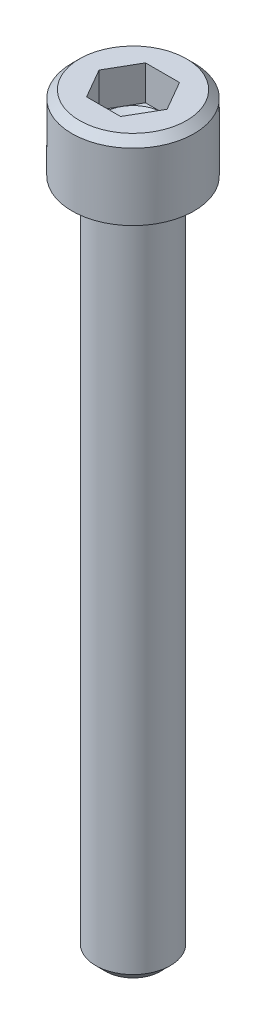
ISO-10303-21;
HEADER;
FILE_DESCRIPTION(('STEP AP214'),'2;1');
FILE_NAME('part.step','',(''),(''),'','','');
FILE_SCHEMA(('AUTOMOTIVE_DESIGN { 1 0 10303 214 1 1 1 1 }'));
ENDSEC;
DATA;
#1=APPLICATION_CONTEXT('core data for automotive mechanical design processes');
#2=APPLICATION_PROTOCOL_DEFINITION('international standard','automotive_design',2000,#1);
#3=PRODUCT_CONTEXT('',#1,'mechanical');
#4=PRODUCT('Part','Part','',(#3));
#5=PRODUCT_RELATED_PRODUCT_CATEGORY('part','',(#4));
#6=PRODUCT_DEFINITION_FORMATION('','',#4);
#7=PRODUCT_DEFINITION_CONTEXT('part definition',#1,'design');
#8=PRODUCT_DEFINITION('design','',#6,#7);
#9=PRODUCT_DEFINITION_SHAPE('','',#8);
#10=(LENGTH_UNIT() NAMED_UNIT(*) SI_UNIT(.MILLI.,.METRE.));
#11=(NAMED_UNIT(*) PLANE_ANGLE_UNIT() SI_UNIT($,.RADIAN.));
#12=(NAMED_UNIT(*) SI_UNIT($,.STERADIAN.) SOLID_ANGLE_UNIT());
#13=UNCERTAINTY_MEASURE_WITH_UNIT(LENGTH_MEASURE(1.E-05),#10,'distance_accuracy_value','');
#14=(GEOMETRIC_REPRESENTATION_CONTEXT(3) GLOBAL_UNCERTAINTY_ASSIGNED_CONTEXT((#13)) GLOBAL_UNIT_ASSIGNED_CONTEXT((#10,
#11,#12)) REPRESENTATION_CONTEXT('',''));
#15=CARTESIAN_POINT('',(0.,0.,0.));
#16=DIRECTION('',(0.,0.,1.));
#17=DIRECTION('',(1.,0.,0.));
#18=AXIS2_PLACEMENT_3D('',#15,#16,#17);
#19=CARTESIAN_POINT('',(0.,1.8796,0.));
#20=DIRECTION('',(0.,1.,0.));
#21=DIRECTION('',(0.,0.,1.));
#22=AXIS2_PLACEMENT_3D('',#19,#20,#21);
#23=PLANE('',#22);
#24=DIRECTION('',(-1.,0.,0.));
#25=VECTOR('',#24,1.);
#26=CARTESIAN_POINT('',(0.799225977638982,1.8796,-1.38429999999987));
#27=LINE('',#26,#25);
#28=CARTESIAN_POINT('',(0.799225977638982,1.8796,-1.38429999999987));
#29=VERTEX_POINT('',#28);
#30=CARTESIAN_POINT('',(0.,1.87959999999497,-1.38429999999987));
#31=VERTEX_POINT('',#30);
#32=EDGE_CURVE('E159',#29,#31,#27,.T.);
#33=ORIENTED_EDGE('',*,*,#32,.T.);
#34=CARTESIAN_POINT('',(0.,1.87959999999497,0.));
#35=DIRECTION('',(0.,-1.,0.));
#36=DIRECTION('',(0.,0.,-1.));
#37=AXIS2_PLACEMENT_3D('',#34,#35,#36);
#38=CIRCLE('',#37,1.38430000004078);
#39=CARTESIAN_POINT('',(1.19883896649411,1.87959999999497,-0.692150000020388));
#40=VERTEX_POINT('',#39);
#41=EDGE_CURVE('E47',#31,#40,#38,.T.);
#42=ORIENTED_EDGE('',*,*,#41,.T.);
#43=DIRECTION('',(-0.5,0.,-0.866025403784439));
#44=VECTOR('',#43,1.);
#45=CARTESIAN_POINT('',(1.59845195527816,1.8796,0.));
#46=LINE('',#45,#44);
#47=EDGE_CURVE('E286',#40,#29,#46,.T.);
#48=ORIENTED_EDGE('',*,*,#47,.T.);
#49=EDGE_LOOP('',(#33,#42,#48));
#50=FACE_BOUND('',#49,.T.);
#51=ADVANCED_FACE('F32',(#50),#23,.T.);
#52=CARTESIAN_POINT('',(1.59845195527816,1.8796,0.));
#53=VERTEX_POINT('',#52);
#54=EDGE_CURVE('E287',#53,#40,#46,.T.);
#55=ORIENTED_EDGE('',*,*,#54,.T.);
#56=CARTESIAN_POINT('',(1.19883896649411,1.87959999999497,0.692150000020388));
#57=VERTEX_POINT('',#56);
#58=EDGE_CURVE('E200',#40,#57,#38,.T.);
#59=ORIENTED_EDGE('',*,*,#58,.T.);
#60=DIRECTION('',(0.5,0.,-0.866025403784439));
#61=VECTOR('',#60,1.);
#62=CARTESIAN_POINT('',(0.799225977639064,1.8796,1.38429999999992));
#63=LINE('',#62,#61);
#64=EDGE_CURVE('E283',#57,#53,#63,.T.);
#65=ORIENTED_EDGE('',*,*,#64,.T.);
#66=EDGE_LOOP('',(#55,#59,#65));
#67=FACE_BOUND('',#66,.T.);
#68=ADVANCED_FACE('F122',(#67),#23,.T.);
#69=CARTESIAN_POINT('',(0.799225977639064,1.8796,1.38429999999992));
#70=VERTEX_POINT('',#69);
#71=EDGE_CURVE('E273',#70,#57,#63,.T.);
#72=ORIENTED_EDGE('',*,*,#71,.T.);
#73=CARTESIAN_POINT('',(0.,1.87959999999497,1.38430000004078));
#74=VERTEX_POINT('',#73);
#75=EDGE_CURVE('E295',#57,#74,#38,.T.);
#76=ORIENTED_EDGE('',*,*,#75,.T.);
#77=DIRECTION('',(1.,0.,0.));
#78=VECTOR('',#77,1.);
#79=CARTESIAN_POINT('',(-0.799225977639255,1.8796,1.38429999999992));
#80=LINE('',#79,#78);
#81=EDGE_CURVE('E181',#74,#70,#80,.T.);
#82=ORIENTED_EDGE('',*,*,#81,.T.);
#83=EDGE_LOOP('',(#72,#76,#82));
#84=FACE_BOUND('',#83,.T.);
#85=ADVANCED_FACE('F128',(#84),#23,.T.);
#86=CARTESIAN_POINT('',(-0.799225977639255,1.8796,1.38429999999992));
#87=VERTEX_POINT('',#86);
#88=EDGE_CURVE('E276',#87,#74,#80,.T.);
#89=ORIENTED_EDGE('',*,*,#88,.T.);
#90=CARTESIAN_POINT('',(-1.19883896649414,1.87959999999497,0.692150000020335));
#91=VERTEX_POINT('',#90);
#92=EDGE_CURVE('E282',#74,#91,#38,.T.);
#93=ORIENTED_EDGE('',*,*,#92,.T.);
#94=DIRECTION('',(0.499999999999962,0.,0.866025403784461));
#95=VECTOR('',#94,1.);
#96=CARTESIAN_POINT('',(-1.59845195527835,1.8796,0.));
#97=LINE('',#96,#95);
#98=EDGE_CURVE('E154',#91,#87,#97,.T.);
#99=ORIENTED_EDGE('',*,*,#98,.T.);
#100=EDGE_LOOP('',(#89,#93,#99));
#101=FACE_BOUND('',#100,.T.);
#102=ADVANCED_FACE('F143',(#101),#23,.T.);
#103=CARTESIAN_POINT('',(-1.59845195527835,1.8796,0.));
#104=VERTEX_POINT('',#103);
#105=EDGE_CURVE('E157',#104,#91,#97,.T.);
#106=ORIENTED_EDGE('',*,*,#105,.T.);
#107=CARTESIAN_POINT('',(-1.19883896649411,1.87959999999497,-0.692150000020388));
#108=VERTEX_POINT('',#107);
#109=EDGE_CURVE('E294',#91,#108,#38,.T.);
#110=ORIENTED_EDGE('',*,*,#109,.T.);
#111=DIRECTION('',(-0.5,0.,0.866025403784439));
#112=VECTOR('',#111,1.);
#113=CARTESIAN_POINT('',(-0.799225977639255,1.8796,-1.38429999999987));
#114=LINE('',#113,#112);
#115=EDGE_CURVE('E155',#108,#104,#114,.T.);
#116=ORIENTED_EDGE('',*,*,#115,.T.);
#117=EDGE_LOOP('',(#106,#110,#116));
#118=FACE_BOUND('',#117,.T.);
#119=ADVANCED_FACE('F134',(#118),#23,.T.);
#120=CARTESIAN_POINT('',(-0.799225977639255,1.8796,-1.38429999999987));
#121=VERTEX_POINT('',#120);
#122=EDGE_CURVE('E147',#121,#108,#114,.T.);
#123=ORIENTED_EDGE('',*,*,#122,.T.);
#124=EDGE_CURVE('E148',#108,#31,#38,.T.);
#125=ORIENTED_EDGE('',*,*,#124,.T.);
#126=EDGE_CURVE('E150',#31,#121,#27,.T.);
#127=ORIENTED_EDGE('',*,*,#126,.T.);
#128=EDGE_LOOP('',(#123,#125,#127));
#129=FACE_BOUND('',#128,.T.);
#130=ADVANCED_FACE('F124',(#129),#23,.T.);
#131=CARTESIAN_POINT('',(0.,0.,0.));
#132=DIRECTION('',(0.,-1.,0.));
#133=DIRECTION('',(0.,0.,-1.));
#134=AXIS2_PLACEMENT_3D('',#131,#132,#133);
#135=PLANE('',#134);
#136=CARTESIAN_POINT('',(0.,0.,0.));
#137=DIRECTION('',(0.,-1.,0.));
#138=DIRECTION('',(0.,0.,-1.));
#139=AXIS2_PLACEMENT_3D('',#136,#137,#138);
#140=CIRCLE('',#139,2.0066);
#141=CARTESIAN_POINT('',(0.,0.,-2.0066));
#142=VERTEX_POINT('',#141);
#143=EDGE_CURVE('E11',#142,#142,#140,.F.);
#144=ORIENTED_EDGE('',*,*,#143,.T.);
#145=EDGE_LOOP('',(#144));
#146=FACE_BOUND('',#145,.T.);
#147=CARTESIAN_POINT('',(0.,0.,0.));
#148=DIRECTION('',(0.,-1.,0.));
#149=DIRECTION('',(0.,0.,-1.));
#150=AXIS2_PLACEMENT_3D('',#147,#148,#149);
#151=CIRCLE('',#150,2.8702);
#152=CARTESIAN_POINT('',(0.,0.,-2.8702));
#153=VERTEX_POINT('',#152);
#154=EDGE_CURVE('E184',#153,#153,#151,.T.);
#155=ORIENTED_EDGE('',*,*,#154,.T.);
#156=EDGE_LOOP('',(#155));
#157=FACE_BOUND('',#156,.T.);
#158=ADVANCED_FACE('F133',(#146,#157),#135,.T.);
#159=CARTESIAN_POINT('',(0.,3.5052,0.));
#160=DIRECTION('',(0.,-1.,0.));
#161=DIRECTION('',(0.,0.,-1.));
#162=AXIS2_PLACEMENT_3D('',#159,#160,#161);
#163=CYLINDRICAL_SURFACE('',#162,2.8702);
#164=CARTESIAN_POINT('',(0.,3.14960000004543,0.));
#165=DIRECTION('',(0.,1.,0.));
#166=DIRECTION('',(0.,0.,1.));
#167=AXIS2_PLACEMENT_3D('',#164,#165,#166);
#168=CIRCLE('',#167,2.8702);
#169=CARTESIAN_POINT('',(0.,3.14960000004543,2.8702));
#170=VERTEX_POINT('',#169);
#171=EDGE_CURVE('E203',#170,#170,#168,.F.);
#172=ORIENTED_EDGE('',*,*,#171,.T.);
#173=EDGE_LOOP('',(#172));
#174=FACE_BOUND('',#173,.T.);
#175=ORIENTED_EDGE('',*,*,#154,.F.);
#176=EDGE_LOOP('',(#175));
#177=FACE_BOUND('',#176,.T.);
#178=ADVANCED_FACE('F140',(#174,#177),#163,.T.);
#179=CARTESIAN_POINT('',(2.8702,3.5052,0.));
#180=DIRECTION('',(0.,1.,0.));
#181=DIRECTION('',(0.,0.,1.));
#182=AXIS2_PLACEMENT_3D('',#179,#180,#181);
#183=PLANE('',#182);
#184=CARTESIAN_POINT('',(0.,3.5052,0.));
#185=DIRECTION('',(0.,1.,0.));
#186=DIRECTION('',(0.,0.,1.));
#187=AXIS2_PLACEMENT_3D('',#184,#185,#186);
#188=CIRCLE('',#187,2.51459999998859);
#189=CARTESIAN_POINT('',(0.,3.5052,2.51459999998859));
#190=VERTEX_POINT('',#189);
#191=EDGE_CURVE('E206',#190,#190,#188,.T.);
#192=ORIENTED_EDGE('',*,*,#191,.T.);
#193=EDGE_LOOP('',(#192));
#194=FACE_BOUND('',#193,.T.);
#195=DIRECTION('',(1.,0.,0.));
#196=VECTOR('',#195,1.);
#197=CARTESIAN_POINT('',(-0.799225977639255,3.5052,1.38429999999992));
#198=LINE('',#197,#196);
#199=CARTESIAN_POINT('',(-0.799225977639255,3.5052,1.38429999999992));
#200=VERTEX_POINT('',#199);
#201=CARTESIAN_POINT('',(0.799225977639064,3.5052,1.38429999999992));
#202=VERTEX_POINT('',#201);
#203=EDGE_CURVE('E55',#200,#202,#198,.T.);
#204=ORIENTED_EDGE('',*,*,#203,.F.);
#205=DIRECTION('',(0.499999999999962,0.,0.866025403784461));
#206=VECTOR('',#205,1.);
#207=CARTESIAN_POINT('',(-1.59845195527835,3.5052,0.));
#208=LINE('',#207,#206);
#209=CARTESIAN_POINT('',(-1.59845195527835,3.5052,0.));
#210=VERTEX_POINT('',#209);
#211=EDGE_CURVE('E178',#210,#200,#208,.T.);
#212=ORIENTED_EDGE('',*,*,#211,.F.);
#213=DIRECTION('',(-0.5,0.,0.866025403784439));
#214=VECTOR('',#213,1.);
#215=CARTESIAN_POINT('',(-0.799225977639255,3.5052,-1.38429999999987));
#216=LINE('',#215,#214);
#217=CARTESIAN_POINT('',(-0.799225977639255,3.5052,-1.38429999999987));
#218=VERTEX_POINT('',#217);
#219=EDGE_CURVE('E175',#218,#210,#216,.T.);
#220=ORIENTED_EDGE('',*,*,#219,.F.);
#221=DIRECTION('',(-1.,0.,0.));
#222=VECTOR('',#221,1.);
#223=CARTESIAN_POINT('',(0.799225977638982,3.5052,-1.38429999999987));
#224=LINE('',#223,#222);
#225=CARTESIAN_POINT('',(0.799225977638982,3.5052,-1.38429999999987));
#226=VERTEX_POINT('',#225);
#227=EDGE_CURVE('E172',#226,#218,#224,.T.);
#228=ORIENTED_EDGE('',*,*,#227,.F.);
#229=DIRECTION('',(-0.5,0.,-0.866025403784439));
#230=VECTOR('',#229,1.);
#231=CARTESIAN_POINT('',(1.59845195527816,3.5052,0.));
#232=LINE('',#231,#230);
#233=CARTESIAN_POINT('',(1.59845195527816,3.5052,0.));
#234=VERTEX_POINT('',#233);
#235=EDGE_CURVE('E169',#234,#226,#232,.T.);
#236=ORIENTED_EDGE('',*,*,#235,.F.);
#237=DIRECTION('',(0.5,0.,-0.866025403784439));
#238=VECTOR('',#237,1.);
#239=CARTESIAN_POINT('',(0.799225977639064,3.5052,1.38429999999992));
#240=LINE('',#239,#238);
#241=EDGE_CURVE('E166',#202,#234,#240,.T.);
#242=ORIENTED_EDGE('',*,*,#241,.F.);
#243=EDGE_LOOP('',(#204,#212,#220,#228,#236,#242));
#244=FACE_BOUND('',#243,.T.);
#245=ADVANCED_FACE('F225',(#194,#244),#183,.T.);
#246=CARTESIAN_POINT('',(0.,-31.75,0.));
#247=DIRECTION('',(0.,1.,0.));
#248=DIRECTION('',(0.,0.,1.));
#249=AXIS2_PLACEMENT_3D('',#246,#247,#248);
#250=CYLINDRICAL_SURFACE('',#249,1.7526);
#251=CARTESIAN_POINT('',(0.,-0.253999999999997,0.));
#252=DIRECTION('',(0.,-1.,0.));
#253=DIRECTION('',(0.,0.,-1.));
#254=AXIS2_PLACEMENT_3D('',#251,#252,#253);
#255=CIRCLE('',#254,1.7526);
#256=CARTESIAN_POINT('',(0.,-0.253999999999997,-1.7526));
#257=VERTEX_POINT('',#256);
#258=EDGE_CURVE('E40',#257,#257,#255,.T.);
#259=ORIENTED_EDGE('',*,*,#258,.T.);
#260=EDGE_LOOP('',(#259));
#261=FACE_BOUND('',#260,.T.);
#262=CARTESIAN_POINT('',(0.,-31.2775599999883,0.));
#263=DIRECTION('',(0.,-1.,0.));
#264=DIRECTION('',(0.,0.,-1.));
#265=AXIS2_PLACEMENT_3D('',#262,#263,#264);
#266=CIRCLE('',#265,1.7526);
#267=CARTESIAN_POINT('',(0.,-31.2775599999883,-1.7526));
#268=VERTEX_POINT('',#267);
#269=EDGE_CURVE('E199',#268,#268,#266,.F.);
#270=ORIENTED_EDGE('',*,*,#269,.T.);
#271=EDGE_LOOP('',(#270));
#272=FACE_BOUND('',#271,.T.);
#273=ADVANCED_FACE('F211',(#261,#272),#250,.T.);
#274=CARTESIAN_POINT('',(0.,-31.75,0.));
#275=DIRECTION('',(0.,-1.,0.));
#276=DIRECTION('',(0.,0.,-1.));
#277=AXIS2_PLACEMENT_3D('',#274,#275,#276);
#278=PLANE('',#277);
#279=CARTESIAN_POINT('',(0.,-31.75,0.));
#280=DIRECTION('',(0.,-1.,0.));
#281=DIRECTION('',(0.,0.,-1.));
#282=AXIS2_PLACEMENT_3D('',#279,#280,#281);
#283=CIRCLE('',#282,1.28015999998831);
#284=CARTESIAN_POINT('',(0.,-31.75,-1.28015999998831));
#285=VERTEX_POINT('',#284);
#286=EDGE_CURVE('E196',#285,#285,#283,.T.);
#287=ORIENTED_EDGE('',*,*,#286,.T.);
#288=EDGE_LOOP('',(#287));
#289=FACE_BOUND('',#288,.T.);
#290=ADVANCED_FACE('F236',(#289),#278,.T.);
#291=CARTESIAN_POINT('',(-0.799225977639255,1.8796,1.38429999999992));
#292=DIRECTION('',(0.,0.,1.));
#293=DIRECTION('',(1.,0.,0.));
#294=AXIS2_PLACEMENT_3D('',#291,#292,#293);
#295=PLANE('',#294);
#296=ORIENTED_EDGE('',*,*,#203,.T.);
#297=DIRECTION('',(0.,1.,0.));
#298=VECTOR('',#297,1.);
#299=CARTESIAN_POINT('',(0.799225977639064,1.8796,1.38429999999992));
#300=LINE('',#299,#298);
#301=EDGE_CURVE('E164',#70,#202,#300,.T.);
#302=ORIENTED_EDGE('',*,*,#301,.F.);
#303=ORIENTED_EDGE('',*,*,#81,.F.);
#304=ORIENTED_EDGE('',*,*,#88,.F.);
#305=DIRECTION('',(0.,1.,0.));
#306=VECTOR('',#305,1.);
#307=CARTESIAN_POINT('',(-0.799225977639255,1.8796,1.38429999999992));
#308=LINE('',#307,#306);
#309=EDGE_CURVE('E182',#87,#200,#308,.T.);
#310=ORIENTED_EDGE('',*,*,#309,.T.);
#311=EDGE_LOOP('',(#296,#302,#303,#304,#310));
#312=FACE_BOUND('',#311,.T.);
#313=ADVANCED_FACE('F239',(#312),#295,.F.);
#314=CARTESIAN_POINT('',(-1.59845195527835,1.8796,0.));
#315=DIRECTION('',(-0.866025403784461,0.,0.499999999999962));
#316=DIRECTION('',(0.499999999999962,0.,0.866025403784461));
#317=AXIS2_PLACEMENT_3D('',#314,#315,#316);
#318=PLANE('',#317);
#319=ORIENTED_EDGE('',*,*,#211,.T.);
#320=ORIENTED_EDGE('',*,*,#309,.F.);
#321=ORIENTED_EDGE('',*,*,#98,.F.);
#322=ORIENTED_EDGE('',*,*,#105,.F.);
#323=DIRECTION('',(0.,1.,0.));
#324=VECTOR('',#323,1.);
#325=CARTESIAN_POINT('',(-1.59845195527835,1.8796,0.));
#326=LINE('',#325,#324);
#327=EDGE_CURVE('E185',#104,#210,#326,.T.);
#328=ORIENTED_EDGE('',*,*,#327,.T.);
#329=EDGE_LOOP('',(#319,#320,#321,#322,#328));
#330=FACE_BOUND('',#329,.T.);
#331=ADVANCED_FACE('F242',(#330),#318,.F.);
#332=CARTESIAN_POINT('',(-0.799225977639255,1.8796,-1.38429999999987));
#333=DIRECTION('',(-0.866025403784439,0.,-0.5));
#334=DIRECTION('',(-0.5,0.,0.866025403784439));
#335=AXIS2_PLACEMENT_3D('',#332,#333,#334);
#336=PLANE('',#335);
#337=ORIENTED_EDGE('',*,*,#219,.T.);
#338=ORIENTED_EDGE('',*,*,#327,.F.);
#339=ORIENTED_EDGE('',*,*,#115,.F.);
#340=ORIENTED_EDGE('',*,*,#122,.F.);
#341=DIRECTION('',(0.,1.,0.));
#342=VECTOR('',#341,1.);
#343=CARTESIAN_POINT('',(-0.799225977639255,1.8796,-1.38429999999987));
#344=LINE('',#343,#342);
#345=EDGE_CURVE('E187',#121,#218,#344,.T.);
#346=ORIENTED_EDGE('',*,*,#345,.T.);
#347=EDGE_LOOP('',(#337,#338,#339,#340,#346));
#348=FACE_BOUND('',#347,.T.);
#349=ADVANCED_FACE('F250',(#348),#336,.F.);
#350=CARTESIAN_POINT('',(0.799225977638982,1.8796,-1.38429999999987));
#351=DIRECTION('',(0.,0.,-1.));
#352=DIRECTION('',(-1.,0.,0.));
#353=AXIS2_PLACEMENT_3D('',#350,#351,#352);
#354=PLANE('',#353);
#355=ORIENTED_EDGE('',*,*,#227,.T.);
#356=ORIENTED_EDGE('',*,*,#345,.F.);
#357=ORIENTED_EDGE('',*,*,#126,.F.);
#358=ORIENTED_EDGE('',*,*,#32,.F.);
#359=DIRECTION('',(0.,1.,0.));
#360=VECTOR('',#359,1.);
#361=CARTESIAN_POINT('',(0.799225977638982,1.8796,-1.38429999999987));
#362=LINE('',#361,#360);
#363=EDGE_CURVE('E189',#29,#226,#362,.T.);
#364=ORIENTED_EDGE('',*,*,#363,.T.);
#365=EDGE_LOOP('',(#355,#356,#357,#358,#364));
#366=FACE_BOUND('',#365,.T.);
#367=ADVANCED_FACE('F246',(#366),#354,.F.);
#368=CARTESIAN_POINT('',(1.59845195527816,1.8796,0.));
#369=DIRECTION('',(0.866025403784439,0.,-0.5));
#370=DIRECTION('',(-0.5,0.,-0.866025403784439));
#371=AXIS2_PLACEMENT_3D('',#368,#369,#370);
#372=PLANE('',#371);
#373=ORIENTED_EDGE('',*,*,#235,.T.);
#374=ORIENTED_EDGE('',*,*,#363,.F.);
#375=ORIENTED_EDGE('',*,*,#47,.F.);
#376=ORIENTED_EDGE('',*,*,#54,.F.);
#377=DIRECTION('',(0.,1.,0.));
#378=VECTOR('',#377,1.);
#379=CARTESIAN_POINT('',(1.59845195527816,1.8796,0.));
#380=LINE('',#379,#378);
#381=EDGE_CURVE('E191',#53,#234,#380,.T.);
#382=ORIENTED_EDGE('',*,*,#381,.T.);
#383=EDGE_LOOP('',(#373,#374,#375,#376,#382));
#384=FACE_BOUND('',#383,.T.);
#385=ADVANCED_FACE('F117',(#384),#372,.F.);
#386=CARTESIAN_POINT('',(0.799225977639064,1.8796,1.38429999999992));
#387=DIRECTION('',(0.866025403784439,0.,0.5));
#388=DIRECTION('',(0.5,0.,-0.866025403784439));
#389=AXIS2_PLACEMENT_3D('',#386,#387,#388);
#390=PLANE('',#389);
#391=ORIENTED_EDGE('',*,*,#241,.T.);
#392=ORIENTED_EDGE('',*,*,#381,.F.);
#393=ORIENTED_EDGE('',*,*,#64,.F.);
#394=ORIENTED_EDGE('',*,*,#71,.F.);
#395=ORIENTED_EDGE('',*,*,#301,.T.);
#396=EDGE_LOOP('',(#391,#392,#393,#394,#395));
#397=FACE_BOUND('',#396,.T.);
#398=ADVANCED_FACE('F108',(#397),#390,.F.);
#399=CARTESIAN_POINT('',(0.,1.08037402233223,0.));
#400=DIRECTION('',(0.,1.,0.));
#401=DIRECTION('',(0.,0.,1.));
#402=AXIS2_PLACEMENT_3D('',#399,#400,#401);
#403=CONICAL_SURFACE('',#402,0.,1.0471975511966);
#404=ORIENTED_EDGE('',*,*,#41,.F.);
#405=ORIENTED_EDGE('',*,*,#124,.F.);
#406=ORIENTED_EDGE('',*,*,#109,.F.);
#407=ORIENTED_EDGE('',*,*,#92,.F.);
#408=ORIENTED_EDGE('',*,*,#75,.F.);
#409=ORIENTED_EDGE('',*,*,#58,.F.);
#410=EDGE_LOOP('',(#404,#405,#406,#407,#408,#409));
#411=FACE_BOUND('',#410,.T.);
#412=CARTESIAN_POINT('',(0.,1.08037402233223,0.));
#413=VERTEX_POINT('',#412);
#414=VERTEX_LOOP('',#413);
#415=FACE_BOUND('',#414,.T.);
#416=ADVANCED_FACE('F105',(#411,#415),#403,.F.);
#417=CARTESIAN_POINT('',(0.,-31.75,0.));
#418=DIRECTION('',(0.,1.,0.));
#419=DIRECTION('',(0.,0.,1.));
#420=AXIS2_PLACEMENT_3D('',#417,#418,#419);
#421=CONICAL_SURFACE('',#420,1.28015999998831,0.785398163397441);
#422=ORIENTED_EDGE('',*,*,#269,.F.);
#423=EDGE_LOOP('',(#422));
#424=FACE_BOUND('',#423,.T.);
#425=ORIENTED_EDGE('',*,*,#286,.F.);
#426=EDGE_LOOP('',(#425));
#427=FACE_BOUND('',#426,.T.);
#428=ADVANCED_FACE('F107',(#424,#427),#421,.T.);
#429=CARTESIAN_POINT('',(0.,3.14960000004543,0.));
#430=DIRECTION('',(0.,-1.,0.));
#431=DIRECTION('',(0.,0.,-1.));
#432=AXIS2_PLACEMENT_3D('',#429,#430,#431);
#433=CONICAL_SURFACE('',#432,2.8702,0.785398163477374);
#434=ORIENTED_EDGE('',*,*,#191,.F.);
#435=EDGE_LOOP('',(#434));
#436=FACE_BOUND('',#435,.T.);
#437=ORIENTED_EDGE('',*,*,#171,.F.);
#438=EDGE_LOOP('',(#437));
#439=FACE_BOUND('',#438,.T.);
#440=ADVANCED_FACE('F114',(#436,#439),#433,.T.);
#441=CARTESIAN_POINT('',(0.,-0.253999999999997,0.));
#442=DIRECTION('',(0.,-1.,0.));
#443=DIRECTION('',(0.,0.,-1.));
#444=AXIS2_PLACEMENT_3D('',#441,#442,#443);
#445=TOROIDAL_SURFACE('',#444,2.0066,0.254);
#446=ORIENTED_EDGE('',*,*,#143,.F.);
#447=EDGE_LOOP('',(#446));
#448=FACE_BOUND('',#447,.T.);
#449=ORIENTED_EDGE('',*,*,#258,.F.);
#450=EDGE_LOOP('',(#449));
#451=FACE_BOUND('',#450,.T.);
#452=ADVANCED_FACE('F34',(#448,#451),#445,.F.);
#453=CLOSED_SHELL('',(#51,#68,#85,#102,#119,#130,#158,#178,#245,#273,#290,#313,#331,#349,#367,
#385,#398,#416,#428,#440,#452));
#454=MANIFOLD_SOLID_BREP('B2',#453);
#455=ADVANCED_BREP_SHAPE_REPRESENTATION('',(#18,#454),#14);
#456=SHAPE_DEFINITION_REPRESENTATION(#9,#455);
ENDSEC;
END-ISO-10303-21;
